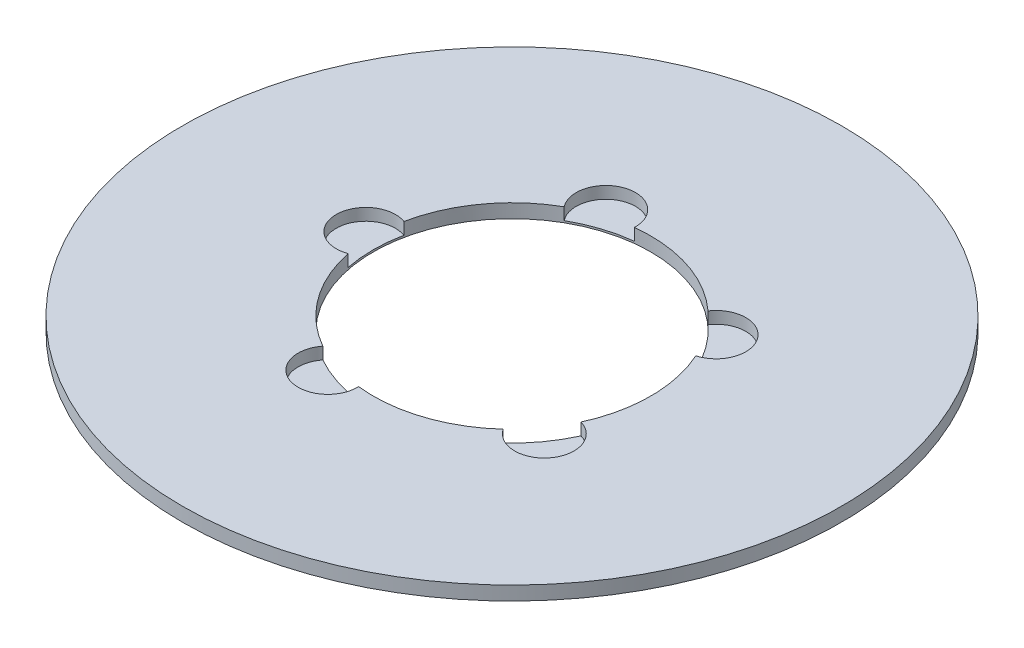
ISO-10303-21;
HEADER;
FILE_DESCRIPTION(('STEP AP214'),'2;1');
FILE_NAME('part.step','',(''),(''),'','','');
FILE_SCHEMA(('AUTOMOTIVE_DESIGN { 1 0 10303 214 1 1 1 1 }'));
ENDSEC;
DATA;
#1=APPLICATION_CONTEXT('core data for automotive mechanical design processes');
#2=APPLICATION_PROTOCOL_DEFINITION('international standard','automotive_design',2000,#1);
#3=PRODUCT_CONTEXT('',#1,'mechanical');
#4=PRODUCT('Part','Part','',(#3));
#5=PRODUCT_RELATED_PRODUCT_CATEGORY('part','',(#4));
#6=PRODUCT_DEFINITION_FORMATION('','',#4);
#7=PRODUCT_DEFINITION_CONTEXT('part definition',#1,'design');
#8=PRODUCT_DEFINITION('design','',#6,#7);
#9=PRODUCT_DEFINITION_SHAPE('','',#8);
#10=(LENGTH_UNIT() NAMED_UNIT(*) SI_UNIT(.MILLI.,.METRE.));
#11=(NAMED_UNIT(*) PLANE_ANGLE_UNIT() SI_UNIT($,.RADIAN.));
#12=(NAMED_UNIT(*) SI_UNIT($,.STERADIAN.) SOLID_ANGLE_UNIT());
#13=UNCERTAINTY_MEASURE_WITH_UNIT(LENGTH_MEASURE(1.E-05),#10,'distance_accuracy_value','');
#14=(GEOMETRIC_REPRESENTATION_CONTEXT(3) GLOBAL_UNCERTAINTY_ASSIGNED_CONTEXT((#13)) GLOBAL_UNIT_ASSIGNED_CONTEXT((#10,
#11,#12)) REPRESENTATION_CONTEXT('',''));
#15=CARTESIAN_POINT('',(0.,0.,0.));
#16=DIRECTION('',(0.,0.,1.));
#17=DIRECTION('',(1.,0.,0.));
#18=AXIS2_PLACEMENT_3D('',#15,#16,#17);
#19=CARTESIAN_POINT('',(0.,4.,0.));
#20=DIRECTION('',(0.,-1.,0.));
#21=DIRECTION('',(0.,0.,-1.));
#22=AXIS2_PLACEMENT_3D('',#19,#20,#21);
#23=CYLINDRICAL_SURFACE('',#22,95.);
#24=CARTESIAN_POINT('',(0.,4.,0.));
#25=DIRECTION('',(0.,1.,0.));
#26=DIRECTION('',(0.,0.,1.));
#27=AXIS2_PLACEMENT_3D('',#24,#25,#26);
#28=CIRCLE('',#27,95.);
#29=CARTESIAN_POINT('',(0.,4.,95.));
#30=VERTEX_POINT('',#29);
#31=EDGE_CURVE('E157',#30,#30,#28,.T.);
#32=ORIENTED_EDGE('',*,*,#31,.F.);
#33=EDGE_LOOP('',(#32));
#34=FACE_BOUND('',#33,.T.);
#35=CARTESIAN_POINT('',(0.,0.,0.));
#36=DIRECTION('',(0.,1.,0.));
#37=DIRECTION('',(0.,0.,1.));
#38=AXIS2_PLACEMENT_3D('',#35,#36,#37);
#39=CIRCLE('',#38,95.);
#40=CARTESIAN_POINT('',(0.,0.,95.));
#41=VERTEX_POINT('',#40);
#42=EDGE_CURVE('E150',#41,#41,#39,.T.);
#43=ORIENTED_EDGE('',*,*,#42,.T.);
#44=EDGE_LOOP('',(#43));
#45=FACE_BOUND('',#44,.T.);
#46=ADVANCED_FACE('F39',(#34,#45),#23,.T.);
#47=CARTESIAN_POINT('',(0.,4.,0.));
#48=DIRECTION('',(0.,1.,0.));
#49=DIRECTION('',(0.,0.,1.));
#50=AXIS2_PLACEMENT_3D('',#47,#48,#49);
#51=PLANE('',#50);
#52=CARTESIAN_POINT('',(-13.0203686383517,4.,-40.0725742062063));
#53=DIRECTION('',(0.,1.,0.));
#54=DIRECTION('',(-0.95105651629515,0.,0.309016994374958));
#55=AXIS2_PLACEMENT_3D('',#52,#53,#54);
#56=CIRCLE('',#55,8.54966347576872);
#57=CARTESIAN_POINT('',(-4.4768423931046,4.,-39.7486840308871));
#58=VERTEX_POINT('',#57);
#59=CARTESIAN_POINT('',(-19.7418486942297,4.,-34.7887828205319));
#60=VERTEX_POINT('',#59);
#61=EDGE_CURVE('E194',#58,#60,#56,.T.);
#62=ORIENTED_EDGE('',*,*,#61,.F.);
#63=CARTESIAN_POINT('',(0.,4.,0.));
#64=DIRECTION('',(0.,1.,0.));
#65=DIRECTION('',(0.,0.,1.));
#66=AXIS2_PLACEMENT_3D('',#63,#64,#65);
#67=CIRCLE('',#66,40.);
#68=CARTESIAN_POINT('',(26.985531848548,4.,-29.5259389495237));
#69=VERTEX_POINT('',#68);
#70=EDGE_CURVE('E147',#69,#58,#67,.T.);
#71=ORIENTED_EDGE('',*,*,#70,.F.);
#72=CARTESIAN_POINT('',(34.0877676412564,4.,-24.7662128761382));
#73=DIRECTION('',(0.,1.,0.));
#74=DIRECTION('',(-0.58778525229248,0.,-0.809016994374942));
#75=AXIS2_PLACEMENT_3D('',#72,#73,#74);
#76=CIRCLE('',#75,8.54966347576872);
#77=CARTESIAN_POINT('',(36.4198245811248,4.,-16.5407489999726));
#78=VERTEX_POINT('',#77);
#79=EDGE_CURVE('E254',#78,#69,#76,.T.);
#80=ORIENTED_EDGE('',*,*,#79,.F.);
#81=CARTESIAN_POINT('',(36.4198245811251,4.,16.5407489999721));
#82=VERTEX_POINT('',#81);
#83=EDGE_CURVE('E144',#82,#78,#67,.T.);
#84=ORIENTED_EDGE('',*,*,#83,.F.);
#85=CARTESIAN_POINT('',(34.0877676412568,4.,24.7662128761378));
#86=DIRECTION('',(0.,1.,0.));
#87=DIRECTION('',(0.587785252292469,0.,-0.809016994374951));
#88=AXIS2_PLACEMENT_3D('',#85,#86,#87);
#89=CIRCLE('',#88,8.54966347576872);
#90=CARTESIAN_POINT('',(26.9855318485485,4.,29.5259389495233));
#91=VERTEX_POINT('',#90);
#92=EDGE_CURVE('E141',#91,#82,#89,.T.);
#93=ORIENTED_EDGE('',*,*,#92,.F.);
#94=CARTESIAN_POINT('',(-4.47684239310404,4.,39.7486840308872));
#95=VERTEX_POINT('',#94);
#96=EDGE_CURVE('E134',#95,#91,#67,.T.);
#97=ORIENTED_EDGE('',*,*,#96,.F.);
#98=CARTESIAN_POINT('',(-13.0203686383511,4.,40.0725742062065));
#99=DIRECTION('',(0.,1.,0.));
#100=DIRECTION('',(0.951056516295155,0.,0.309016994374945));
#101=AXIS2_PLACEMENT_3D('',#98,#99,#100);
#102=CIRCLE('',#101,8.54966347576872);
#103=CARTESIAN_POINT('',(-19.7418486942293,4.,34.7887828205322));
#104=VERTEX_POINT('',#103);
#105=EDGE_CURVE('E111',#104,#95,#102,.T.);
#106=ORIENTED_EDGE('',*,*,#105,.F.);
#107=CARTESIAN_POINT('',(-39.1866653423398,4.,8.02528873919613));
#108=VERTEX_POINT('',#107);
#109=EDGE_CURVE('E145',#108,#104,#67,.T.);
#110=ORIENTED_EDGE('',*,*,#109,.F.);
#111=CARTESIAN_POINT('',(-42.1347980058109,4.,0.));
#112=DIRECTION('',(0.,1.,0.));
#113=DIRECTION('',(0.,0.,1.));
#114=AXIS2_PLACEMENT_3D('',#111,#112,#113);
#115=CIRCLE('',#114,8.54966347576872);
#116=CARTESIAN_POINT('',(-39.1866653423398,4.,-8.02528873919613));
#117=VERTEX_POINT('',#116);
#118=EDGE_CURVE('E153',#117,#108,#115,.T.);
#119=ORIENTED_EDGE('',*,*,#118,.F.);
#120=EDGE_CURVE('E146',#60,#117,#67,.T.);
#121=ORIENTED_EDGE('',*,*,#120,.F.);
#122=EDGE_LOOP('',(#62,#71,#80,#84,#93,#97,#106,#110,#119,#121));
#123=FACE_BOUND('',#122,.T.);
#124=ORIENTED_EDGE('',*,*,#31,.T.);
#125=EDGE_LOOP('',(#124));
#126=FACE_BOUND('',#125,.T.);
#127=ADVANCED_FACE('F139',(#123,#126),#51,.T.);
#128=CARTESIAN_POINT('',(0.,0.,0.));
#129=DIRECTION('',(0.,1.,0.));
#130=DIRECTION('',(0.,0.,1.));
#131=AXIS2_PLACEMENT_3D('',#128,#129,#130);
#132=PLANE('',#131);
#133=CARTESIAN_POINT('',(0.,0.,0.));
#134=DIRECTION('',(0.,1.,0.));
#135=DIRECTION('',(0.,0.,1.));
#136=AXIS2_PLACEMENT_3D('',#133,#134,#135);
#137=CIRCLE('',#136,40.);
#138=CARTESIAN_POINT('',(0.,0.,40.));
#139=VERTEX_POINT('',#138);
#140=EDGE_CURVE('E154',#139,#139,#137,.T.);
#141=ORIENTED_EDGE('',*,*,#140,.T.);
#142=EDGE_LOOP('',(#141));
#143=FACE_BOUND('',#142,.T.);
#144=ORIENTED_EDGE('',*,*,#42,.F.);
#145=EDGE_LOOP('',(#144));
#146=FACE_BOUND('',#145,.T.);
#147=ADVANCED_FACE('F213',(#143,#146),#132,.F.);
#148=CARTESIAN_POINT('',(0.,4.,0.));
#149=DIRECTION('',(0.,-1.,0.));
#150=DIRECTION('',(0.,0.,-1.));
#151=AXIS2_PLACEMENT_3D('',#148,#149,#150);
#152=CYLINDRICAL_SURFACE('',#151,40.);
#153=DIRECTION('',(0.,1.,0.));
#154=VECTOR('',#153,1.);
#155=CARTESIAN_POINT('',(-4.4768423931046,2.27306102751025,-39.7486840308871));
#156=LINE('',#155,#154);
#157=CARTESIAN_POINT('',(-4.4768423931046,0.546122055020491,-39.7486840308871));
#158=VERTEX_POINT('',#157);
#159=EDGE_CURVE('E11',#158,#58,#156,.T.);
#160=ORIENTED_EDGE('',*,*,#159,.F.);
#161=CARTESIAN_POINT('',(0.,0.546122055020491,0.));
#162=DIRECTION('',(0.,1.,0.));
#163=DIRECTION('',(0.,0.,1.));
#164=AXIS2_PLACEMENT_3D('',#161,#162,#163);
#165=CIRCLE('',#164,40.);
#166=CARTESIAN_POINT('',(-19.7418486942297,0.546122055020491,-34.7887828205319));
#167=VERTEX_POINT('',#166);
#168=EDGE_CURVE('E189',#158,#167,#165,.T.);
#169=ORIENTED_EDGE('',*,*,#168,.T.);
#170=DIRECTION('',(0.,1.,0.));
#171=VECTOR('',#170,1.);
#172=CARTESIAN_POINT('',(-19.7418486942297,2.27306102751025,-34.7887828205319));
#173=LINE('',#172,#171);
#174=EDGE_CURVE('E46',#60,#167,#173,.F.);
#175=ORIENTED_EDGE('',*,*,#174,.F.);
#176=ORIENTED_EDGE('',*,*,#120,.T.);
#177=DIRECTION('',(0.,1.,0.));
#178=VECTOR('',#177,1.);
#179=CARTESIAN_POINT('',(-39.1866653423398,2.27306102751025,-8.02528873919614));
#180=LINE('',#179,#178);
#181=CARTESIAN_POINT('',(-39.1866653423398,0.546122055020491,-8.02528873919613));
#182=VERTEX_POINT('',#181);
#183=EDGE_CURVE('E168',#182,#117,#180,.T.);
#184=ORIENTED_EDGE('',*,*,#183,.F.);
#185=CARTESIAN_POINT('',(0.,0.546122055020491,0.));
#186=DIRECTION('',(0.,1.,0.));
#187=DIRECTION('',(0.,0.,1.));
#188=AXIS2_PLACEMENT_3D('',#185,#186,#187);
#189=CIRCLE('',#188,40.);
#190=CARTESIAN_POINT('',(-39.1866653423398,0.546122055020491,8.02528873919613));
#191=VERTEX_POINT('',#190);
#192=EDGE_CURVE('E165',#182,#191,#189,.T.);
#193=ORIENTED_EDGE('',*,*,#192,.T.);
#194=DIRECTION('',(0.,1.,0.));
#195=VECTOR('',#194,1.);
#196=CARTESIAN_POINT('',(-39.1866653423398,2.27306102751025,8.02528873919614));
#197=LINE('',#196,#195);
#198=EDGE_CURVE('E170',#108,#191,#197,.F.);
#199=ORIENTED_EDGE('',*,*,#198,.F.);
#200=ORIENTED_EDGE('',*,*,#109,.T.);
#201=DIRECTION('',(0.,1.,0.));
#202=VECTOR('',#201,1.);
#203=CARTESIAN_POINT('',(-19.7418486942293,2.27306102751025,34.7887828205322));
#204=LINE('',#203,#202);
#205=CARTESIAN_POINT('',(-19.7418486942293,0.546122055020491,34.7887828205322));
#206=VERTEX_POINT('',#205);
#207=EDGE_CURVE('E121',#206,#104,#204,.T.);
#208=ORIENTED_EDGE('',*,*,#207,.F.);
#209=CARTESIAN_POINT('',(0.,0.546122055020491,0.));
#210=DIRECTION('',(0.,1.,0.));
#211=DIRECTION('',(0.,0.,1.));
#212=AXIS2_PLACEMENT_3D('',#209,#210,#211);
#213=CIRCLE('',#212,40.);
#214=CARTESIAN_POINT('',(-4.47684239310404,0.546122055020491,39.7486840308872));
#215=VERTEX_POINT('',#214);
#216=EDGE_CURVE('E136',#206,#215,#213,.T.);
#217=ORIENTED_EDGE('',*,*,#216,.T.);
#218=DIRECTION('',(0.,1.,0.));
#219=VECTOR('',#218,1.);
#220=CARTESIAN_POINT('',(-4.47684239310404,2.27306102751025,39.7486840308872));
#221=LINE('',#220,#219);
#222=EDGE_CURVE('E117',#95,#215,#221,.F.);
#223=ORIENTED_EDGE('',*,*,#222,.F.);
#224=ORIENTED_EDGE('',*,*,#96,.T.);
#225=DIRECTION('',(0.,1.,0.));
#226=VECTOR('',#225,1.);
#227=CARTESIAN_POINT('',(26.9855318485485,2.27306102751025,29.5259389495233));
#228=LINE('',#227,#226);
#229=CARTESIAN_POINT('',(26.9855318485485,0.546122055020491,29.5259389495233));
#230=VERTEX_POINT('',#229);
#231=EDGE_CURVE('E182',#230,#91,#228,.T.);
#232=ORIENTED_EDGE('',*,*,#231,.F.);
#233=CARTESIAN_POINT('',(0.,0.546122055020491,0.));
#234=DIRECTION('',(0.,1.,0.));
#235=DIRECTION('',(0.,0.,1.));
#236=AXIS2_PLACEMENT_3D('',#233,#234,#235);
#237=CIRCLE('',#236,40.);
#238=CARTESIAN_POINT('',(36.4198245811251,0.546122055020491,16.5407489999721));
#239=VERTEX_POINT('',#238);
#240=EDGE_CURVE('E174',#230,#239,#237,.T.);
#241=ORIENTED_EDGE('',*,*,#240,.T.);
#242=DIRECTION('',(0.,1.,0.));
#243=VECTOR('',#242,1.);
#244=CARTESIAN_POINT('',(36.4198245811251,2.27306102751025,16.5407489999721));
#245=LINE('',#244,#243);
#246=EDGE_CURVE('E177',#82,#239,#245,.F.);
#247=ORIENTED_EDGE('',*,*,#246,.F.);
#248=ORIENTED_EDGE('',*,*,#83,.T.);
#249=DIRECTION('',(0.,1.,0.));
#250=VECTOR('',#249,1.);
#251=CARTESIAN_POINT('',(36.4198245811248,2.27306102751025,-16.5407489999726));
#252=LINE('',#251,#250);
#253=CARTESIAN_POINT('',(36.4198245811248,0.546122055020491,-16.5407489999726));
#254=VERTEX_POINT('',#253);
#255=EDGE_CURVE('E187',#254,#78,#252,.T.);
#256=ORIENTED_EDGE('',*,*,#255,.F.);
#257=CARTESIAN_POINT('',(0.,0.546122055020491,0.));
#258=DIRECTION('',(0.,1.,0.));
#259=DIRECTION('',(0.,0.,1.));
#260=AXIS2_PLACEMENT_3D('',#257,#258,#259);
#261=CIRCLE('',#260,40.);
#262=CARTESIAN_POINT('',(26.985531848548,0.546122055020491,-29.5259389495237));
#263=VERTEX_POINT('',#262);
#264=EDGE_CURVE('E181',#254,#263,#261,.T.);
#265=ORIENTED_EDGE('',*,*,#264,.T.);
#266=DIRECTION('',(0.,1.,0.));
#267=VECTOR('',#266,1.);
#268=CARTESIAN_POINT('',(26.985531848548,2.27306102751025,-29.5259389495237));
#269=LINE('',#268,#267);
#270=EDGE_CURVE('E186',#69,#263,#269,.F.);
#271=ORIENTED_EDGE('',*,*,#270,.F.);
#272=ORIENTED_EDGE('',*,*,#70,.T.);
#273=EDGE_LOOP('',(#160,#169,#175,#176,#184,#193,#199,#200,#208,#217,#223,#224,#232,#241,#247,
#248,#256,#265,#271,#272));
#274=FACE_BOUND('',#273,.T.);
#275=ORIENTED_EDGE('',*,*,#140,.F.);
#276=EDGE_LOOP('',(#275));
#277=FACE_BOUND('',#276,.T.);
#278=ADVANCED_FACE('F135',(#274,#277),#152,.F.);
#279=CARTESIAN_POINT('',(-42.1347980058109,0.546122055020491,0.));
#280=DIRECTION('',(0.,1.,0.));
#281=DIRECTION('',(0.,0.,1.));
#282=AXIS2_PLACEMENT_3D('',#279,#280,#281);
#283=CYLINDRICAL_SURFACE('',#282,8.54966347576872);
#284=ORIENTED_EDGE('',*,*,#183,.T.);
#285=ORIENTED_EDGE('',*,*,#118,.T.);
#286=ORIENTED_EDGE('',*,*,#198,.T.);
#287=CARTESIAN_POINT('',(-42.1347980058109,0.546122055020491,0.));
#288=DIRECTION('',(0.,1.,0.));
#289=DIRECTION('',(0.,0.,1.));
#290=AXIS2_PLACEMENT_3D('',#287,#288,#289);
#291=CIRCLE('',#290,8.54966347576872);
#292=EDGE_CURVE('E158',#182,#191,#291,.T.);
#293=ORIENTED_EDGE('',*,*,#292,.F.);
#294=EDGE_LOOP('',(#284,#285,#286,#293));
#295=FACE_BOUND('',#294,.T.);
#296=ADVANCED_FACE('F221',(#295),#283,.F.);
#297=CARTESIAN_POINT('',(-42.1347980058109,0.546122055020491,0.));
#298=DIRECTION('',(0.,1.,0.));
#299=DIRECTION('',(0.,0.,1.));
#300=AXIS2_PLACEMENT_3D('',#297,#298,#299);
#301=PLANE('',#300);
#302=ORIENTED_EDGE('',*,*,#292,.T.);
#303=ORIENTED_EDGE('',*,*,#192,.F.);
#304=EDGE_LOOP('',(#302,#303));
#305=FACE_BOUND('',#304,.T.);
#306=ADVANCED_FACE('F227',(#305),#301,.T.);
#307=CARTESIAN_POINT('',(-13.0203686383511,0.546122055020491,40.0725742062065));
#308=DIRECTION('',(0.,1.,0.));
#309=DIRECTION('',(0.,0.,1.));
#310=AXIS2_PLACEMENT_3D('',#307,#308,#309);
#311=CYLINDRICAL_SURFACE('',#310,8.54966347576872);
#312=ORIENTED_EDGE('',*,*,#207,.T.);
#313=ORIENTED_EDGE('',*,*,#105,.T.);
#314=ORIENTED_EDGE('',*,*,#222,.T.);
#315=CARTESIAN_POINT('',(-13.0203686383511,0.546122055020491,40.0725742062065));
#316=DIRECTION('',(0.,1.,0.));
#317=DIRECTION('',(0.951056516295155,0.,0.309016994374945));
#318=AXIS2_PLACEMENT_3D('',#315,#316,#317);
#319=CIRCLE('',#318,8.54966347576872);
#320=EDGE_CURVE('E127',#206,#215,#319,.T.);
#321=ORIENTED_EDGE('',*,*,#320,.F.);
#322=EDGE_LOOP('',(#312,#313,#314,#321));
#323=FACE_BOUND('',#322,.T.);
#324=ADVANCED_FACE('F116',(#323),#311,.F.);
#325=CARTESIAN_POINT('',(-13.0203686383511,0.546122055020491,40.0725742062065));
#326=DIRECTION('',(0.,1.,0.));
#327=DIRECTION('',(0.951056516295155,0.,0.309016994374945));
#328=AXIS2_PLACEMENT_3D('',#325,#326,#327);
#329=PLANE('',#328);
#330=ORIENTED_EDGE('',*,*,#320,.T.);
#331=ORIENTED_EDGE('',*,*,#216,.F.);
#332=EDGE_LOOP('',(#330,#331));
#333=FACE_BOUND('',#332,.T.);
#334=ADVANCED_FACE('F234',(#333),#329,.T.);
#335=CARTESIAN_POINT('',(34.0877676412568,0.546122055020491,24.7662128761378));
#336=DIRECTION('',(0.,1.,0.));
#337=DIRECTION('',(0.,0.,1.));
#338=AXIS2_PLACEMENT_3D('',#335,#336,#337);
#339=CYLINDRICAL_SURFACE('',#338,8.54966347576872);
#340=ORIENTED_EDGE('',*,*,#231,.T.);
#341=ORIENTED_EDGE('',*,*,#92,.T.);
#342=ORIENTED_EDGE('',*,*,#246,.T.);
#343=CARTESIAN_POINT('',(34.0877676412568,0.546122055020491,24.7662128761378));
#344=DIRECTION('',(0.,1.,0.));
#345=DIRECTION('',(0.587785252292469,0.,-0.809016994374951));
#346=AXIS2_PLACEMENT_3D('',#343,#344,#345);
#347=CIRCLE('',#346,8.54966347576872);
#348=EDGE_CURVE('E130',#230,#239,#347,.T.);
#349=ORIENTED_EDGE('',*,*,#348,.F.);
#350=EDGE_LOOP('',(#340,#341,#342,#349));
#351=FACE_BOUND('',#350,.T.);
#352=ADVANCED_FACE('F240',(#351),#339,.F.);
#353=CARTESIAN_POINT('',(34.0877676412568,0.546122055020491,24.7662128761378));
#354=DIRECTION('',(0.,1.,0.));
#355=DIRECTION('',(0.587785252292469,0.,-0.809016994374951));
#356=AXIS2_PLACEMENT_3D('',#353,#354,#355);
#357=PLANE('',#356);
#358=ORIENTED_EDGE('',*,*,#348,.T.);
#359=ORIENTED_EDGE('',*,*,#240,.F.);
#360=EDGE_LOOP('',(#358,#359));
#361=FACE_BOUND('',#360,.T.);
#362=ADVANCED_FACE('F245',(#361),#357,.T.);
#363=CARTESIAN_POINT('',(34.0877676412564,0.546122055020491,-24.7662128761382));
#364=DIRECTION('',(0.,1.,0.));
#365=DIRECTION('',(0.,0.,1.));
#366=AXIS2_PLACEMENT_3D('',#363,#364,#365);
#367=CYLINDRICAL_SURFACE('',#366,8.54966347576872);
#368=ORIENTED_EDGE('',*,*,#255,.T.);
#369=ORIENTED_EDGE('',*,*,#79,.T.);
#370=ORIENTED_EDGE('',*,*,#270,.T.);
#371=CARTESIAN_POINT('',(34.0877676412564,0.546122055020491,-24.7662128761382));
#372=DIRECTION('',(0.,1.,0.));
#373=DIRECTION('',(-0.58778525229248,0.,-0.809016994374942));
#374=AXIS2_PLACEMENT_3D('',#371,#372,#373);
#375=CIRCLE('',#374,8.54966347576872);
#376=EDGE_CURVE('E56',#254,#263,#375,.T.);
#377=ORIENTED_EDGE('',*,*,#376,.F.);
#378=EDGE_LOOP('',(#368,#369,#370,#377));
#379=FACE_BOUND('',#378,.T.);
#380=ADVANCED_FACE('F266',(#379),#367,.F.);
#381=CARTESIAN_POINT('',(34.0877676412564,0.546122055020491,-24.7662128761382));
#382=DIRECTION('',(0.,1.,0.));
#383=DIRECTION('',(-0.58778525229248,0.,-0.809016994374942));
#384=AXIS2_PLACEMENT_3D('',#381,#382,#383);
#385=PLANE('',#384);
#386=ORIENTED_EDGE('',*,*,#376,.T.);
#387=ORIENTED_EDGE('',*,*,#264,.F.);
#388=EDGE_LOOP('',(#386,#387));
#389=FACE_BOUND('',#388,.T.);
#390=ADVANCED_FACE('F204',(#389),#385,.T.);
#391=CARTESIAN_POINT('',(-13.0203686383517,0.546122055020491,-40.0725742062063));
#392=DIRECTION('',(0.,1.,0.));
#393=DIRECTION('',(0.,0.,1.));
#394=AXIS2_PLACEMENT_3D('',#391,#392,#393);
#395=CYLINDRICAL_SURFACE('',#394,8.54966347576872);
#396=ORIENTED_EDGE('',*,*,#159,.T.);
#397=ORIENTED_EDGE('',*,*,#61,.T.);
#398=ORIENTED_EDGE('',*,*,#174,.T.);
#399=CARTESIAN_POINT('',(-13.0203686383517,0.546122055020491,-40.0725742062063));
#400=DIRECTION('',(0.,1.,0.));
#401=DIRECTION('',(-0.95105651629515,0.,0.309016994374958));
#402=AXIS2_PLACEMENT_3D('',#399,#400,#401);
#403=CIRCLE('',#402,8.54966347576872);
#404=EDGE_CURVE('E55',#158,#167,#403,.T.);
#405=ORIENTED_EDGE('',*,*,#404,.F.);
#406=EDGE_LOOP('',(#396,#397,#398,#405));
#407=FACE_BOUND('',#406,.T.);
#408=ADVANCED_FACE('F193',(#407),#395,.F.);
#409=CARTESIAN_POINT('',(-13.0203686383517,0.546122055020491,-40.0725742062063));
#410=DIRECTION('',(0.,1.,0.));
#411=DIRECTION('',(-0.95105651629515,0.,0.309016994374958));
#412=AXIS2_PLACEMENT_3D('',#409,#410,#411);
#413=PLANE('',#412);
#414=ORIENTED_EDGE('',*,*,#404,.T.);
#415=ORIENTED_EDGE('',*,*,#168,.F.);
#416=EDGE_LOOP('',(#414,#415));
#417=FACE_BOUND('',#416,.T.);
#418=ADVANCED_FACE('F196',(#417),#413,.T.);
#419=CLOSED_SHELL('',(#46,#127,#147,#278,#296,#306,#324,#334,#352,#362,#380,#390,#408,#418));
#420=MANIFOLD_SOLID_BREP('B2',#419);
#421=ADVANCED_BREP_SHAPE_REPRESENTATION('',(#18,#420),#14);
#422=SHAPE_DEFINITION_REPRESENTATION(#9,#421);
ENDSEC;
END-ISO-10303-21;
